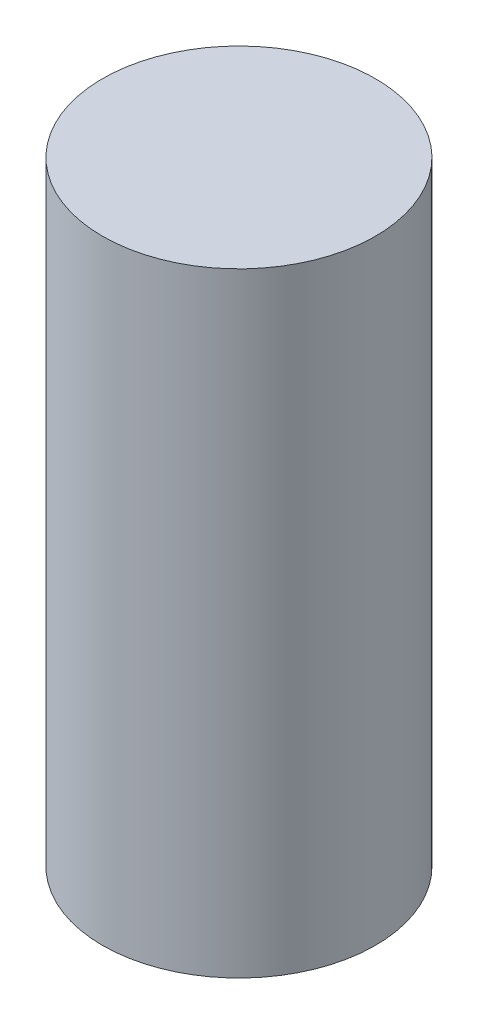
ISO-10303-21;
HEADER;
FILE_DESCRIPTION(('STEP AP214'),'2;1');
FILE_NAME('part.step','',(''),(''),'','','');
FILE_SCHEMA(('AUTOMOTIVE_DESIGN { 1 0 10303 214 1 1 1 1 }'));
ENDSEC;
DATA;
#1=APPLICATION_CONTEXT('core data for automotive mechanical design processes');
#2=APPLICATION_PROTOCOL_DEFINITION('international standard','automotive_design',2000,#1);
#3=PRODUCT_CONTEXT('',#1,'mechanical');
#4=PRODUCT('Part','Part','',(#3));
#5=PRODUCT_RELATED_PRODUCT_CATEGORY('part','',(#4));
#6=PRODUCT_DEFINITION_FORMATION('','',#4);
#7=PRODUCT_DEFINITION_CONTEXT('part definition',#1,'design');
#8=PRODUCT_DEFINITION('design','',#6,#7);
#9=PRODUCT_DEFINITION_SHAPE('','',#8);
#10=(LENGTH_UNIT() NAMED_UNIT(*) SI_UNIT(.MILLI.,.METRE.));
#11=(NAMED_UNIT(*) PLANE_ANGLE_UNIT() SI_UNIT($,.RADIAN.));
#12=(NAMED_UNIT(*) SI_UNIT($,.STERADIAN.) SOLID_ANGLE_UNIT());
#13=UNCERTAINTY_MEASURE_WITH_UNIT(LENGTH_MEASURE(1.E-05),#10,'distance_accuracy_value','');
#14=(GEOMETRIC_REPRESENTATION_CONTEXT(3) GLOBAL_UNCERTAINTY_ASSIGNED_CONTEXT((#13)) GLOBAL_UNIT_ASSIGNED_CONTEXT((#10,
#11,#12)) REPRESENTATION_CONTEXT('',''));
#15=CARTESIAN_POINT('',(0.,0.,0.));
#16=DIRECTION('',(0.,0.,1.));
#17=DIRECTION('',(1.,0.,0.));
#18=AXIS2_PLACEMENT_3D('',#15,#16,#17);
#19=CARTESIAN_POINT('',(0.,18.675,0.));
#20=DIRECTION('',(0.,-1.,0.));
#21=DIRECTION('',(0.,0.,-1.));
#22=AXIS2_PLACEMENT_3D('',#19,#20,#21);
#23=CYLINDRICAL_SURFACE('',#22,3.3);
#24=CARTESIAN_POINT('',(0.,18.675,0.));
#25=DIRECTION('',(0.,1.,0.));
#26=DIRECTION('',(0.,0.,1.));
#27=AXIS2_PLACEMENT_3D('',#24,#25,#26);
#28=CIRCLE('',#27,3.3);
#29=CARTESIAN_POINT('',(0.,18.675,3.3));
#30=VERTEX_POINT('',#29);
#31=EDGE_CURVE('E10',#30,#30,#28,.T.);
#32=ORIENTED_EDGE('',*,*,#31,.F.);
#33=EDGE_LOOP('',(#32));
#34=FACE_BOUND('',#33,.T.);
#35=CARTESIAN_POINT('',(0.,3.825,0.));
#36=DIRECTION('',(0.,1.,0.));
#37=DIRECTION('',(0.,0.,1.));
#38=AXIS2_PLACEMENT_3D('',#35,#36,#37);
#39=CIRCLE('',#38,3.3);
#40=CARTESIAN_POINT('',(0.,3.825,3.3));
#41=VERTEX_POINT('',#40);
#42=EDGE_CURVE('E36',#41,#41,#39,.T.);
#43=ORIENTED_EDGE('',*,*,#42,.T.);
#44=EDGE_LOOP('',(#43));
#45=FACE_BOUND('',#44,.T.);
#46=ADVANCED_FACE('F33',(#34,#45),#23,.T.);
#47=CARTESIAN_POINT('',(0.,18.675,0.));
#48=DIRECTION('',(0.,1.,0.));
#49=DIRECTION('',(0.,0.,1.));
#50=AXIS2_PLACEMENT_3D('',#47,#48,#49);
#51=PLANE('',#50);
#52=ORIENTED_EDGE('',*,*,#31,.T.);
#53=EDGE_LOOP('',(#52));
#54=FACE_BOUND('',#53,.T.);
#55=ADVANCED_FACE('F48',(#54),#51,.T.);
#56=CARTESIAN_POINT('',(0.,3.825,0.));
#57=DIRECTION('',(0.,1.,0.));
#58=DIRECTION('',(0.,0.,1.));
#59=AXIS2_PLACEMENT_3D('',#56,#57,#58);
#60=PLANE('',#59);
#61=ORIENTED_EDGE('',*,*,#42,.F.);
#62=EDGE_LOOP('',(#61));
#63=FACE_BOUND('',#62,.T.);
#64=ADVANCED_FACE('F46',(#63),#60,.F.);
#65=CLOSED_SHELL('',(#46,#55,#64));
#66=MANIFOLD_SOLID_BREP('B2',#65);
#67=ADVANCED_BREP_SHAPE_REPRESENTATION('',(#18,#66),#14);
#68=SHAPE_DEFINITION_REPRESENTATION(#9,#67);
ENDSEC;
END-ISO-10303-21;
